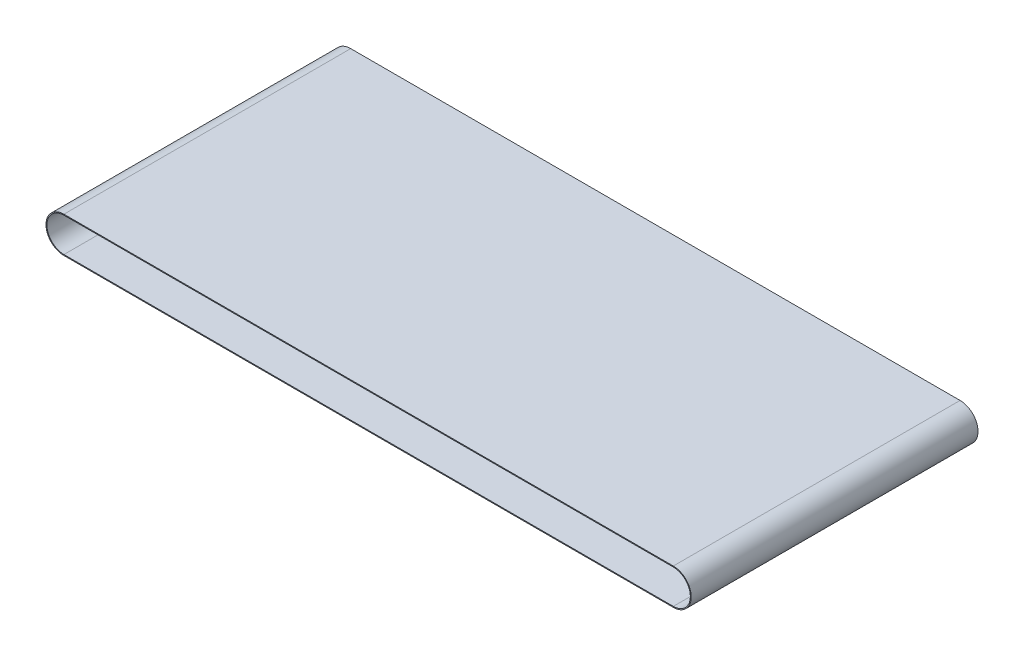
ISO-10303-21;
HEADER;
FILE_DESCRIPTION(('STEP AP214'),'2;1');
FILE_NAME('part.step','',(''),(''),'','','');
FILE_SCHEMA(('AUTOMOTIVE_DESIGN { 1 0 10303 214 1 1 1 1 }'));
ENDSEC;
DATA;
#1=APPLICATION_CONTEXT('core data for automotive mechanical design processes');
#2=APPLICATION_PROTOCOL_DEFINITION('international standard','automotive_design',2000,#1);
#3=PRODUCT_CONTEXT('',#1,'mechanical');
#4=PRODUCT('Part','Part','',(#3));
#5=PRODUCT_RELATED_PRODUCT_CATEGORY('part','',(#4));
#6=PRODUCT_DEFINITION_FORMATION('','',#4);
#7=PRODUCT_DEFINITION_CONTEXT('part definition',#1,'design');
#8=PRODUCT_DEFINITION('design','',#6,#7);
#9=PRODUCT_DEFINITION_SHAPE('','',#8);
#10=(LENGTH_UNIT() NAMED_UNIT(*) SI_UNIT(.MILLI.,.METRE.));
#11=(NAMED_UNIT(*) PLANE_ANGLE_UNIT() SI_UNIT($,.RADIAN.));
#12=(NAMED_UNIT(*) SI_UNIT($,.STERADIAN.) SOLID_ANGLE_UNIT());
#13=UNCERTAINTY_MEASURE_WITH_UNIT(LENGTH_MEASURE(1.E-05),#10,'distance_accuracy_value','');
#14=(GEOMETRIC_REPRESENTATION_CONTEXT(3) GLOBAL_UNCERTAINTY_ASSIGNED_CONTEXT((#13)) GLOBAL_UNIT_ASSIGNED_CONTEXT((#10,
#11,#12)) REPRESENTATION_CONTEXT('',''));
#15=CARTESIAN_POINT('',(0.,0.,0.));
#16=DIRECTION('',(0.,0.,1.));
#17=DIRECTION('',(1.,0.,0.));
#18=AXIS2_PLACEMENT_3D('',#15,#16,#17);
#19=CARTESIAN_POINT('',(-425.,0.,400.));
#20=DIRECTION('',(0.,0.,1.));
#21=DIRECTION('',(1.,0.,0.));
#22=AXIS2_PLACEMENT_3D('',#19,#20,#21);
#23=PLANE('',#22);
#24=CARTESIAN_POINT('',(-425.,0.,400.));
#25=DIRECTION('',(0.,0.,1.));
#26=DIRECTION('',(1.,0.,0.));
#27=AXIS2_PLACEMENT_3D('',#24,#25,#26);
#28=CIRCLE('',#27,25.);
#29=CARTESIAN_POINT('',(-425.,25.,400.));
#30=VERTEX_POINT('',#29);
#31=CARTESIAN_POINT('',(-425.,-25.,400.));
#32=VERTEX_POINT('',#31);
#33=EDGE_CURVE('E134',#30,#32,#28,.T.);
#34=ORIENTED_EDGE('',*,*,#33,.T.);
#35=DIRECTION('',(1.,0.,0.));
#36=VECTOR('',#35,1.);
#37=CARTESIAN_POINT('',(-425.,-25.,400.));
#38=LINE('',#37,#36);
#39=CARTESIAN_POINT('',(425.,-24.9999999999998,400.));
#40=VERTEX_POINT('',#39);
#41=EDGE_CURVE('E137',#32,#40,#38,.T.);
#42=ORIENTED_EDGE('',*,*,#41,.T.);
#43=CARTESIAN_POINT('',(425.,1.56142466891288E-13,400.));
#44=DIRECTION('',(0.,0.,1.));
#45=DIRECTION('',(1.,0.,0.));
#46=AXIS2_PLACEMENT_3D('',#43,#44,#45);
#47=CIRCLE('',#46,25.);
#48=CARTESIAN_POINT('',(425.,25.0000000000002,400.));
#49=VERTEX_POINT('',#48);
#50=EDGE_CURVE('E140',#40,#49,#47,.T.);
#51=ORIENTED_EDGE('',*,*,#50,.T.);
#52=DIRECTION('',(-1.,0.,0.));
#53=VECTOR('',#52,1.);
#54=CARTESIAN_POINT('',(-425.,25.,400.));
#55=LINE('',#54,#53);
#56=EDGE_CURVE('E142',#49,#30,#55,.T.);
#57=ORIENTED_EDGE('',*,*,#56,.T.);
#58=EDGE_LOOP('',(#34,#42,#51,#57));
#59=FACE_BOUND('',#58,.T.);
#60=DIRECTION('',(1.,0.,0.));
#61=VECTOR('',#60,1.);
#62=CARTESIAN_POINT('',(-425.,-23.75,400.));
#63=LINE('',#62,#61);
#64=CARTESIAN_POINT('',(-425.,-23.75,400.));
#65=VERTEX_POINT('',#64);
#66=CARTESIAN_POINT('',(425.,-23.7499999999998,400.));
#67=VERTEX_POINT('',#66);
#68=EDGE_CURVE('E106',#65,#67,#63,.T.);
#69=ORIENTED_EDGE('',*,*,#68,.F.);
#70=CARTESIAN_POINT('',(-425.,0.,400.));
#71=DIRECTION('',(0.,0.,1.));
#72=DIRECTION('',(1.,0.,0.));
#73=AXIS2_PLACEMENT_3D('',#70,#71,#72);
#74=CIRCLE('',#73,23.75);
#75=CARTESIAN_POINT('',(-425.,23.75,400.));
#76=VERTEX_POINT('',#75);
#77=EDGE_CURVE('E98',#76,#65,#74,.T.);
#78=ORIENTED_EDGE('',*,*,#77,.F.);
#79=DIRECTION('',(-1.,0.,0.));
#80=VECTOR('',#79,1.);
#81=CARTESIAN_POINT('',(-425.,23.75,400.));
#82=LINE('',#81,#80);
#83=CARTESIAN_POINT('',(425.,23.7500000000002,400.));
#84=VERTEX_POINT('',#83);
#85=EDGE_CURVE('E120',#84,#76,#82,.T.);
#86=ORIENTED_EDGE('',*,*,#85,.F.);
#87=CARTESIAN_POINT('',(425.,1.56142466891288E-13,400.));
#88=DIRECTION('',(0.,0.,1.));
#89=DIRECTION('',(1.,0.,0.));
#90=AXIS2_PLACEMENT_3D('',#87,#88,#89);
#91=CIRCLE('',#90,23.75);
#92=EDGE_CURVE('E118',#67,#84,#91,.T.);
#93=ORIENTED_EDGE('',*,*,#92,.F.);
#94=EDGE_LOOP('',(#69,#78,#86,#93));
#95=FACE_BOUND('',#94,.T.);
#96=ADVANCED_FACE('F33',(#59,#95),#23,.T.);
#97=CARTESIAN_POINT('',(-425.,0.,0.));
#98=DIRECTION('',(0.,0.,1.));
#99=DIRECTION('',(1.,0.,0.));
#100=AXIS2_PLACEMENT_3D('',#97,#98,#99);
#101=PLANE('',#100);
#102=CARTESIAN_POINT('',(-425.,0.,0.));
#103=DIRECTION('',(0.,0.,1.));
#104=DIRECTION('',(1.,0.,0.));
#105=AXIS2_PLACEMENT_3D('',#102,#103,#104);
#106=CIRCLE('',#105,25.);
#107=CARTESIAN_POINT('',(-425.,25.,0.));
#108=VERTEX_POINT('',#107);
#109=CARTESIAN_POINT('',(-425.,-25.,0.));
#110=VERTEX_POINT('',#109);
#111=EDGE_CURVE('E114',#108,#110,#106,.T.);
#112=ORIENTED_EDGE('',*,*,#111,.F.);
#113=DIRECTION('',(-1.,0.,0.));
#114=VECTOR('',#113,1.);
#115=CARTESIAN_POINT('',(-425.,25.,0.));
#116=LINE('',#115,#114);
#117=CARTESIAN_POINT('',(425.,25.0000000000002,0.));
#118=VERTEX_POINT('',#117);
#119=EDGE_CURVE('E138',#118,#108,#116,.T.);
#120=ORIENTED_EDGE('',*,*,#119,.F.);
#121=CARTESIAN_POINT('',(425.,1.56142466891288E-13,0.));
#122=DIRECTION('',(0.,0.,1.));
#123=DIRECTION('',(1.,0.,0.));
#124=AXIS2_PLACEMENT_3D('',#121,#122,#123);
#125=CIRCLE('',#124,25.);
#126=CARTESIAN_POINT('',(425.,-24.9999999999998,0.));
#127=VERTEX_POINT('',#126);
#128=EDGE_CURVE('E149',#127,#118,#125,.T.);
#129=ORIENTED_EDGE('',*,*,#128,.F.);
#130=DIRECTION('',(1.,0.,0.));
#131=VECTOR('',#130,1.);
#132=CARTESIAN_POINT('',(-425.,-25.,0.));
#133=LINE('',#132,#131);
#134=EDGE_CURVE('E147',#110,#127,#133,.T.);
#135=ORIENTED_EDGE('',*,*,#134,.F.);
#136=EDGE_LOOP('',(#112,#120,#129,#135));
#137=FACE_BOUND('',#136,.T.);
#138=CARTESIAN_POINT('',(-425.,0.,0.));
#139=DIRECTION('',(0.,0.,1.));
#140=DIRECTION('',(1.,0.,0.));
#141=AXIS2_PLACEMENT_3D('',#138,#139,#140);
#142=CIRCLE('',#141,23.75);
#143=CARTESIAN_POINT('',(-425.,23.75,0.));
#144=VERTEX_POINT('',#143);
#145=CARTESIAN_POINT('',(-425.,-23.75,0.));
#146=VERTEX_POINT('',#145);
#147=EDGE_CURVE('E56',#144,#146,#142,.T.);
#148=ORIENTED_EDGE('',*,*,#147,.T.);
#149=DIRECTION('',(1.,0.,0.));
#150=VECTOR('',#149,1.);
#151=CARTESIAN_POINT('',(-425.,-23.75,0.));
#152=LINE('',#151,#150);
#153=CARTESIAN_POINT('',(425.,-23.7499999999998,0.));
#154=VERTEX_POINT('',#153);
#155=EDGE_CURVE('E113',#146,#154,#152,.T.);
#156=ORIENTED_EDGE('',*,*,#155,.T.);
#157=CARTESIAN_POINT('',(425.,1.56142466891288E-13,0.));
#158=DIRECTION('',(0.,0.,1.));
#159=DIRECTION('',(1.,0.,0.));
#160=AXIS2_PLACEMENT_3D('',#157,#158,#159);
#161=CIRCLE('',#160,23.75);
#162=CARTESIAN_POINT('',(425.,23.7500000000002,0.));
#163=VERTEX_POINT('',#162);
#164=EDGE_CURVE('E126',#154,#163,#161,.T.);
#165=ORIENTED_EDGE('',*,*,#164,.T.);
#166=DIRECTION('',(-1.,0.,0.));
#167=VECTOR('',#166,1.);
#168=CARTESIAN_POINT('',(-425.,23.75,0.));
#169=LINE('',#168,#167);
#170=EDGE_CURVE('E107',#163,#144,#169,.T.);
#171=ORIENTED_EDGE('',*,*,#170,.T.);
#172=EDGE_LOOP('',(#148,#156,#165,#171));
#173=FACE_BOUND('',#172,.T.);
#174=ADVANCED_FACE('F167',(#137,#173),#101,.F.);
#175=CARTESIAN_POINT('',(-425.,0.,400.));
#176=DIRECTION('',(0.,0.,-1.));
#177=DIRECTION('',(-1.,0.,0.));
#178=AXIS2_PLACEMENT_3D('',#175,#176,#177);
#179=CYLINDRICAL_SURFACE('',#178,25.);
#180=ORIENTED_EDGE('',*,*,#111,.T.);
#181=DIRECTION('',(0.,0.,-1.));
#182=VECTOR('',#181,1.);
#183=CARTESIAN_POINT('',(-425.,-25.,400.));
#184=LINE('',#183,#182);
#185=EDGE_CURVE('E11',#32,#110,#184,.T.);
#186=ORIENTED_EDGE('',*,*,#185,.F.);
#187=ORIENTED_EDGE('',*,*,#33,.F.);
#188=DIRECTION('',(0.,0.,-1.));
#189=VECTOR('',#188,1.);
#190=CARTESIAN_POINT('',(-425.,25.,400.));
#191=LINE('',#190,#189);
#192=EDGE_CURVE('E144',#30,#108,#191,.T.);
#193=ORIENTED_EDGE('',*,*,#192,.T.);
#194=EDGE_LOOP('',(#180,#186,#187,#193));
#195=FACE_BOUND('',#194,.T.);
#196=ADVANCED_FACE('F35',(#195),#179,.T.);
#197=CARTESIAN_POINT('',(-425.,-25.,400.));
#198=DIRECTION('',(0.,1.,0.));
#199=DIRECTION('',(-1.,0.,0.));
#200=AXIS2_PLACEMENT_3D('',#197,#198,#199);
#201=PLANE('',#200);
#202=ORIENTED_EDGE('',*,*,#134,.T.);
#203=DIRECTION('',(0.,0.,-1.));
#204=VECTOR('',#203,1.);
#205=CARTESIAN_POINT('',(425.,-24.9999999999998,400.));
#206=LINE('',#205,#204);
#207=EDGE_CURVE('E41',#40,#127,#206,.T.);
#208=ORIENTED_EDGE('',*,*,#207,.F.);
#209=ORIENTED_EDGE('',*,*,#41,.F.);
#210=ORIENTED_EDGE('',*,*,#185,.T.);
#211=EDGE_LOOP('',(#202,#208,#209,#210));
#212=FACE_BOUND('',#211,.T.);
#213=ADVANCED_FACE('F177',(#212),#201,.F.);
#214=CARTESIAN_POINT('',(425.,1.56142466891288E-13,400.));
#215=DIRECTION('',(0.,0.,-1.));
#216=DIRECTION('',(-1.,0.,0.));
#217=AXIS2_PLACEMENT_3D('',#214,#215,#216);
#218=CYLINDRICAL_SURFACE('',#217,25.);
#219=ORIENTED_EDGE('',*,*,#128,.T.);
#220=DIRECTION('',(0.,0.,-1.));
#221=VECTOR('',#220,1.);
#222=CARTESIAN_POINT('',(425.,25.0000000000002,400.));
#223=LINE('',#222,#221);
#224=EDGE_CURVE('E154',#49,#118,#223,.T.);
#225=ORIENTED_EDGE('',*,*,#224,.F.);
#226=ORIENTED_EDGE('',*,*,#50,.F.);
#227=ORIENTED_EDGE('',*,*,#207,.T.);
#228=EDGE_LOOP('',(#219,#225,#226,#227));
#229=FACE_BOUND('',#228,.T.);
#230=ADVANCED_FACE('F161',(#229),#218,.T.);
#231=CARTESIAN_POINT('',(-425.,25.,400.));
#232=DIRECTION('',(0.,-1.,0.));
#233=DIRECTION('',(1.,0.,0.));
#234=AXIS2_PLACEMENT_3D('',#231,#232,#233);
#235=PLANE('',#234);
#236=ORIENTED_EDGE('',*,*,#119,.T.);
#237=ORIENTED_EDGE('',*,*,#192,.F.);
#238=ORIENTED_EDGE('',*,*,#56,.F.);
#239=ORIENTED_EDGE('',*,*,#224,.T.);
#240=EDGE_LOOP('',(#236,#237,#238,#239));
#241=FACE_BOUND('',#240,.T.);
#242=ADVANCED_FACE('F171',(#241),#235,.F.);
#243=CARTESIAN_POINT('',(-425.,0.,400.));
#244=DIRECTION('',(0.,0.,-1.));
#245=DIRECTION('',(-1.,0.,0.));
#246=AXIS2_PLACEMENT_3D('',#243,#244,#245);
#247=CYLINDRICAL_SURFACE('',#246,23.75);
#248=ORIENTED_EDGE('',*,*,#147,.F.);
#249=DIRECTION('',(0.,0.,-1.));
#250=VECTOR('',#249,1.);
#251=CARTESIAN_POINT('',(-425.,23.75,400.));
#252=LINE('',#251,#250);
#253=EDGE_CURVE('E102',#76,#144,#252,.T.);
#254=ORIENTED_EDGE('',*,*,#253,.F.);
#255=ORIENTED_EDGE('',*,*,#77,.T.);
#256=DIRECTION('',(0.,0.,-1.));
#257=VECTOR('',#256,1.);
#258=CARTESIAN_POINT('',(-425.,-23.75,400.));
#259=LINE('',#258,#257);
#260=EDGE_CURVE('E101',#65,#146,#259,.T.);
#261=ORIENTED_EDGE('',*,*,#260,.T.);
#262=EDGE_LOOP('',(#248,#254,#255,#261));
#263=FACE_BOUND('',#262,.T.);
#264=ADVANCED_FACE('F100',(#263),#247,.F.);
#265=CARTESIAN_POINT('',(-425.,-23.75,400.));
#266=DIRECTION('',(0.,1.,0.));
#267=DIRECTION('',(-1.,0.,0.));
#268=AXIS2_PLACEMENT_3D('',#265,#266,#267);
#269=PLANE('',#268);
#270=ORIENTED_EDGE('',*,*,#155,.F.);
#271=ORIENTED_EDGE('',*,*,#260,.F.);
#272=ORIENTED_EDGE('',*,*,#68,.T.);
#273=DIRECTION('',(0.,0.,-1.));
#274=VECTOR('',#273,1.);
#275=CARTESIAN_POINT('',(425.,-23.7499999999998,400.));
#276=LINE('',#275,#274);
#277=EDGE_CURVE('E115',#67,#154,#276,.T.);
#278=ORIENTED_EDGE('',*,*,#277,.T.);
#279=EDGE_LOOP('',(#270,#271,#272,#278));
#280=FACE_BOUND('',#279,.T.);
#281=ADVANCED_FACE('F110',(#280),#269,.T.);
#282=CARTESIAN_POINT('',(425.,1.56142466891288E-13,400.));
#283=DIRECTION('',(0.,0.,-1.));
#284=DIRECTION('',(-1.,0.,0.));
#285=AXIS2_PLACEMENT_3D('',#282,#283,#284);
#286=CYLINDRICAL_SURFACE('',#285,23.75);
#287=ORIENTED_EDGE('',*,*,#164,.F.);
#288=ORIENTED_EDGE('',*,*,#277,.F.);
#289=ORIENTED_EDGE('',*,*,#92,.T.);
#290=DIRECTION('',(0.,0.,-1.));
#291=VECTOR('',#290,1.);
#292=CARTESIAN_POINT('',(425.,23.7500000000002,400.));
#293=LINE('',#292,#291);
#294=EDGE_CURVE('E48',#84,#163,#293,.T.);
#295=ORIENTED_EDGE('',*,*,#294,.T.);
#296=EDGE_LOOP('',(#287,#288,#289,#295));
#297=FACE_BOUND('',#296,.T.);
#298=ADVANCED_FACE('F200',(#297),#286,.F.);
#299=CARTESIAN_POINT('',(-425.,23.75,400.));
#300=DIRECTION('',(0.,-1.,0.));
#301=DIRECTION('',(1.,0.,0.));
#302=AXIS2_PLACEMENT_3D('',#299,#300,#301);
#303=PLANE('',#302);
#304=ORIENTED_EDGE('',*,*,#170,.F.);
#305=ORIENTED_EDGE('',*,*,#294,.F.);
#306=ORIENTED_EDGE('',*,*,#85,.T.);
#307=ORIENTED_EDGE('',*,*,#253,.T.);
#308=EDGE_LOOP('',(#304,#305,#306,#307));
#309=FACE_BOUND('',#308,.T.);
#310=ADVANCED_FACE('F204',(#309),#303,.T.);
#311=CLOSED_SHELL('',(#96,#174,#196,#213,#230,#242,#264,#281,#298,#310));
#312=MANIFOLD_SOLID_BREP('B2',#311);
#313=ADVANCED_BREP_SHAPE_REPRESENTATION('',(#18,#312),#14);
#314=SHAPE_DEFINITION_REPRESENTATION(#9,#313);
ENDSEC;
END-ISO-10303-21;
